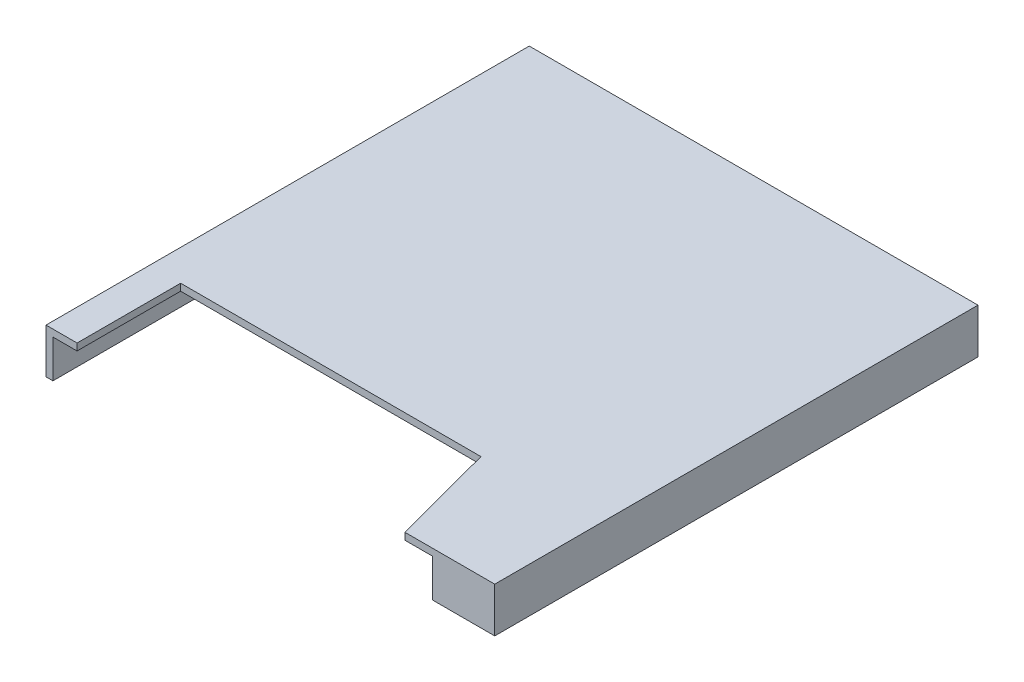
ISO-10303-21;
HEADER;
FILE_DESCRIPTION(('STEP AP214'),'2;1');
FILE_NAME('part.step','',(''),(''),'','','');
FILE_SCHEMA(('AUTOMOTIVE_DESIGN { 1 0 10303 214 1 1 1 1 }'));
ENDSEC;
DATA;
#1=APPLICATION_CONTEXT('core data for automotive mechanical design processes');
#2=APPLICATION_PROTOCOL_DEFINITION('international standard','automotive_design',2000,#1);
#3=PRODUCT_CONTEXT('',#1,'mechanical');
#4=PRODUCT('Part','Part','',(#3));
#5=PRODUCT_RELATED_PRODUCT_CATEGORY('part','',(#4));
#6=PRODUCT_DEFINITION_FORMATION('','',#4);
#7=PRODUCT_DEFINITION_CONTEXT('part definition',#1,'design');
#8=PRODUCT_DEFINITION('design','',#6,#7);
#9=PRODUCT_DEFINITION_SHAPE('','',#8);
#10=(LENGTH_UNIT() NAMED_UNIT(*) SI_UNIT(.MILLI.,.METRE.));
#11=(NAMED_UNIT(*) PLANE_ANGLE_UNIT() SI_UNIT($,.RADIAN.));
#12=(NAMED_UNIT(*) SI_UNIT($,.STERADIAN.) SOLID_ANGLE_UNIT());
#13=UNCERTAINTY_MEASURE_WITH_UNIT(LENGTH_MEASURE(1.E-05),#10,'distance_accuracy_value','');
#14=(GEOMETRIC_REPRESENTATION_CONTEXT(3) GLOBAL_UNCERTAINTY_ASSIGNED_CONTEXT((#13)) GLOBAL_UNIT_ASSIGNED_CONTEXT((#10,
#11,#12)) REPRESENTATION_CONTEXT('',''));
#15=CARTESIAN_POINT('',(0.,0.,0.));
#16=DIRECTION('',(0.,0.,1.));
#17=DIRECTION('',(1.,0.,0.));
#18=AXIS2_PLACEMENT_3D('',#15,#16,#17);
#19=CARTESIAN_POINT('',(6.5,0.,-6.8));
#20=DIRECTION('',(0.,0.,-1.));
#21=DIRECTION('',(-1.,0.,0.));
#22=AXIS2_PLACEMENT_3D('',#19,#20,#21);
#23=PLANE('',#22);
#24=DIRECTION('',(0.,1.,0.));
#25=VECTOR('',#24,1.);
#26=CARTESIAN_POINT('',(6.3,0.,-6.8));
#27=LINE('',#26,#25);
#28=CARTESIAN_POINT('',(6.3,0.,-6.8));
#29=VERTEX_POINT('',#28);
#30=CARTESIAN_POINT('',(6.3,1.1,-6.8));
#31=VERTEX_POINT('',#30);
#32=EDGE_CURVE('E20',#29,#31,#27,.T.);
#33=ORIENTED_EDGE('',*,*,#32,.T.);
#34=DIRECTION('',(1.,0.,0.));
#35=VECTOR('',#34,1.);
#36=CARTESIAN_POINT('',(0.,1.1,-6.8));
#37=LINE('',#36,#35);
#38=CARTESIAN_POINT('',(-6.3,1.1,-6.8));
#39=VERTEX_POINT('',#38);
#40=EDGE_CURVE('E122',#31,#39,#37,.F.);
#41=ORIENTED_EDGE('',*,*,#40,.T.);
#42=DIRECTION('',(0.,1.,0.));
#43=VECTOR('',#42,1.);
#44=CARTESIAN_POINT('',(-6.3,0.,-6.8));
#45=LINE('',#44,#43);
#46=CARTESIAN_POINT('',(-6.3,0.,-6.8));
#47=VERTEX_POINT('',#46);
#48=EDGE_CURVE('E131',#39,#47,#45,.F.);
#49=ORIENTED_EDGE('',*,*,#48,.T.);
#50=DIRECTION('',(1.,0.,0.));
#51=VECTOR('',#50,1.);
#52=CARTESIAN_POINT('',(0.,0.,-6.8));
#53=LINE('',#52,#51);
#54=EDGE_CURVE('E125',#47,#29,#53,.T.);
#55=ORIENTED_EDGE('',*,*,#54,.T.);
#56=EDGE_LOOP('',(#33,#41,#49,#55));
#57=FACE_BOUND('',#56,.T.);
#58=ADVANCED_FACE('F17',(#57),#23,.F.);
#59=CARTESIAN_POINT('',(6.3,0.,7.));
#60=DIRECTION('',(1.,0.,0.));
#61=DIRECTION('',(0.,0.,-1.));
#62=AXIS2_PLACEMENT_3D('',#59,#60,#61);
#63=PLANE('',#62);
#64=DIRECTION('',(0.,0.,1.));
#65=VECTOR('',#64,1.);
#66=CARTESIAN_POINT('',(6.3,1.1,0.));
#67=LINE('',#66,#65);
#68=CARTESIAN_POINT('',(6.3,1.1,6.8));
#69=VERTEX_POINT('',#68);
#70=EDGE_CURVE('E128',#69,#31,#67,.F.);
#71=ORIENTED_EDGE('',*,*,#70,.T.);
#72=ORIENTED_EDGE('',*,*,#32,.F.);
#73=DIRECTION('',(0.,0.,1.));
#74=VECTOR('',#73,1.);
#75=CARTESIAN_POINT('',(6.3,0.,0.));
#76=LINE('',#75,#74);
#77=CARTESIAN_POINT('',(6.3,0.,6.8));
#78=VERTEX_POINT('',#77);
#79=EDGE_CURVE('E156',#29,#78,#76,.T.);
#80=ORIENTED_EDGE('',*,*,#79,.T.);
#81=DIRECTION('',(0.,1.,0.));
#82=VECTOR('',#81,1.);
#83=CARTESIAN_POINT('',(6.3,1.1,6.8));
#84=LINE('',#83,#82);
#85=EDGE_CURVE('E116',#69,#78,#84,.F.);
#86=ORIENTED_EDGE('',*,*,#85,.F.);
#87=EDGE_LOOP('',(#71,#72,#80,#86));
#88=FACE_BOUND('',#87,.T.);
#89=ADVANCED_FACE('F129',(#88),#63,.F.);
#90=CARTESIAN_POINT('',(4.7,1.1,6.8));
#91=DIRECTION('',(0.,0.,-1.));
#92=DIRECTION('',(-1.,0.,0.));
#93=AXIS2_PLACEMENT_3D('',#90,#91,#92);
#94=PLANE('',#93);
#95=DIRECTION('',(1.,0.,0.));
#96=VECTOR('',#95,1.);
#97=CARTESIAN_POINT('',(0.,1.1,6.8));
#98=LINE('',#97,#96);
#99=CARTESIAN_POINT('',(4.7,1.1,6.8));
#100=VERTEX_POINT('',#99);
#101=EDGE_CURVE('E152',#100,#69,#98,.T.);
#102=ORIENTED_EDGE('',*,*,#101,.T.);
#103=ORIENTED_EDGE('',*,*,#85,.T.);
#104=DIRECTION('',(1.,0.,0.));
#105=VECTOR('',#104,1.);
#106=CARTESIAN_POINT('',(0.,0.,6.8));
#107=LINE('',#106,#105);
#108=CARTESIAN_POINT('',(4.7,0.,6.8));
#109=VERTEX_POINT('',#108);
#110=EDGE_CURVE('E150',#78,#109,#107,.F.);
#111=ORIENTED_EDGE('',*,*,#110,.T.);
#112=DIRECTION('',(0.,1.,0.));
#113=VECTOR('',#112,1.);
#114=CARTESIAN_POINT('',(4.7,1.1,6.8));
#115=LINE('',#114,#113);
#116=EDGE_CURVE('E166',#100,#109,#115,.F.);
#117=ORIENTED_EDGE('',*,*,#116,.F.);
#118=EDGE_LOOP('',(#102,#103,#111,#117));
#119=FACE_BOUND('',#118,.T.);
#120=ADVANCED_FACE('F148',(#119),#94,.T.);
#121=CARTESIAN_POINT('',(-6.3,0.,-7.));
#122=DIRECTION('',(-1.,0.,0.));
#123=DIRECTION('',(0.,0.,1.));
#124=AXIS2_PLACEMENT_3D('',#121,#122,#123);
#125=PLANE('',#124);
#126=ORIENTED_EDGE('',*,*,#48,.F.);
#127=DIRECTION('',(0.,0.,1.));
#128=VECTOR('',#127,1.);
#129=CARTESIAN_POINT('',(-6.3,1.1,0.));
#130=LINE('',#129,#128);
#131=CARTESIAN_POINT('',(-6.3,1.1,7.));
#132=VERTEX_POINT('',#131);
#133=EDGE_CURVE('E138',#39,#132,#130,.T.);
#134=ORIENTED_EDGE('',*,*,#133,.T.);
#135=DIRECTION('',(0.,1.,0.));
#136=VECTOR('',#135,1.);
#137=CARTESIAN_POINT('',(-6.3,0.,7.));
#138=LINE('',#137,#136);
#139=CARTESIAN_POINT('',(-6.3,0.,7.));
#140=VERTEX_POINT('',#139);
#141=EDGE_CURVE('E145',#140,#132,#138,.T.);
#142=ORIENTED_EDGE('',*,*,#141,.F.);
#143=DIRECTION('',(0.,0.,1.));
#144=VECTOR('',#143,1.);
#145=CARTESIAN_POINT('',(-6.3,0.,0.));
#146=LINE('',#145,#144);
#147=EDGE_CURVE('E187',#140,#47,#146,.F.);
#148=ORIENTED_EDGE('',*,*,#147,.T.);
#149=EDGE_LOOP('',(#126,#134,#142,#148));
#150=FACE_BOUND('',#149,.T.);
#151=ADVANCED_FACE('F231',(#150),#125,.F.);
#152=CARTESIAN_POINT('',(0.,1.1,0.));
#153=DIRECTION('',(0.,1.,0.));
#154=DIRECTION('',(0.,0.,1.));
#155=AXIS2_PLACEMENT_3D('',#152,#153,#154);
#156=PLANE('',#155);
#157=DIRECTION('',(0.,0.,1.));
#158=VECTOR('',#157,1.);
#159=CARTESIAN_POINT('',(4.7,1.1,7.));
#160=LINE('',#159,#158);
#161=CARTESIAN_POINT('',(4.7,1.1,7.));
#162=VERTEX_POINT('',#161);
#163=EDGE_CURVE('E168',#162,#100,#160,.F.);
#164=ORIENTED_EDGE('',*,*,#163,.F.);
#165=DIRECTION('',(1.,0.,0.));
#166=VECTOR('',#165,1.);
#167=CARTESIAN_POINT('',(0.,1.1,7.));
#168=LINE('',#167,#166);
#169=CARTESIAN_POINT('',(3.9,1.1,7.));
#170=VERTEX_POINT('',#169);
#171=EDGE_CURVE('E172',#170,#162,#168,.T.);
#172=ORIENTED_EDGE('',*,*,#171,.F.);
#173=DIRECTION('',(-0.257662650560333,0.,-0.966234939601246));
#174=VECTOR('',#173,1.);
#175=CARTESIAN_POINT('',(3.1,1.1,4.));
#176=LINE('',#175,#174);
#177=CARTESIAN_POINT('',(3.1,1.1,4.));
#178=VERTEX_POINT('',#177);
#179=EDGE_CURVE('E222',#170,#178,#176,.T.);
#180=ORIENTED_EDGE('',*,*,#179,.T.);
#181=DIRECTION('',(-1.,0.,0.));
#182=VECTOR('',#181,1.);
#183=CARTESIAN_POINT('',(-5.6,1.1,4.));
#184=LINE('',#183,#182);
#185=CARTESIAN_POINT('',(-5.6,1.1,4.));
#186=VERTEX_POINT('',#185);
#187=EDGE_CURVE('E183',#178,#186,#184,.T.);
#188=ORIENTED_EDGE('',*,*,#187,.T.);
#189=DIRECTION('',(0.,0.,1.));
#190=VECTOR('',#189,1.);
#191=CARTESIAN_POINT('',(-5.6,1.1,7.));
#192=LINE('',#191,#190);
#193=CARTESIAN_POINT('',(-5.6,1.1,7.));
#194=VERTEX_POINT('',#193);
#195=EDGE_CURVE('E181',#186,#194,#192,.T.);
#196=ORIENTED_EDGE('',*,*,#195,.T.);
#197=DIRECTION('',(1.,0.,0.));
#198=VECTOR('',#197,1.);
#199=CARTESIAN_POINT('',(0.,1.1,7.));
#200=LINE('',#199,#198);
#201=EDGE_CURVE('E140',#132,#194,#200,.T.);
#202=ORIENTED_EDGE('',*,*,#201,.F.);
#203=ORIENTED_EDGE('',*,*,#133,.F.);
#204=ORIENTED_EDGE('',*,*,#40,.F.);
#205=ORIENTED_EDGE('',*,*,#70,.F.);
#206=ORIENTED_EDGE('',*,*,#101,.F.);
#207=EDGE_LOOP('',(#164,#172,#180,#188,#196,#202,#203,#204,#205,#206));
#208=FACE_BOUND('',#207,.T.);
#209=ADVANCED_FACE('F135',(#208),#156,.F.);
#210=CARTESIAN_POINT('',(4.7,1.1,7.));
#211=DIRECTION('',(-1.,0.,0.));
#212=DIRECTION('',(0.,0.,1.));
#213=AXIS2_PLACEMENT_3D('',#210,#211,#212);
#214=PLANE('',#213);
#215=ORIENTED_EDGE('',*,*,#163,.T.);
#216=ORIENTED_EDGE('',*,*,#116,.T.);
#217=DIRECTION('',(0.,0.,1.));
#218=VECTOR('',#217,1.);
#219=CARTESIAN_POINT('',(4.7,0.,0.));
#220=LINE('',#219,#218);
#221=CARTESIAN_POINT('',(4.7,0.,7.));
#222=VERTEX_POINT('',#221);
#223=EDGE_CURVE('E158',#109,#222,#220,.T.);
#224=ORIENTED_EDGE('',*,*,#223,.T.);
#225=DIRECTION('',(0.,1.,0.));
#226=VECTOR('',#225,1.);
#227=CARTESIAN_POINT('',(4.7,0.,7.));
#228=LINE('',#227,#226);
#229=EDGE_CURVE('E216',#162,#222,#228,.F.);
#230=ORIENTED_EDGE('',*,*,#229,.F.);
#231=EDGE_LOOP('',(#215,#216,#224,#230));
#232=FACE_BOUND('',#231,.T.);
#233=ADVANCED_FACE('F239',(#232),#214,.T.);
#234=CARTESIAN_POINT('',(0.,0.,0.));
#235=DIRECTION('',(0.,1.,0.));
#236=DIRECTION('',(0.,0.,1.));
#237=AXIS2_PLACEMENT_3D('',#234,#235,#236);
#238=PLANE('',#237);
#239=DIRECTION('',(1.,0.,0.));
#240=VECTOR('',#239,1.);
#241=CARTESIAN_POINT('',(0.,0.,7.));
#242=LINE('',#241,#240);
#243=CARTESIAN_POINT('',(-6.5,0.,7.));
#244=VERTEX_POINT('',#243);
#245=EDGE_CURVE('E160',#244,#140,#242,.T.);
#246=ORIENTED_EDGE('',*,*,#245,.F.);
#247=DIRECTION('',(0.,0.,1.));
#248=VECTOR('',#247,1.);
#249=CARTESIAN_POINT('',(-6.5,0.,-7.));
#250=LINE('',#249,#248);
#251=CARTESIAN_POINT('',(-6.5,0.,-7.));
#252=VERTEX_POINT('',#251);
#253=EDGE_CURVE('E196',#252,#244,#250,.T.);
#254=ORIENTED_EDGE('',*,*,#253,.F.);
#255=DIRECTION('',(-1.,0.,0.));
#256=VECTOR('',#255,1.);
#257=CARTESIAN_POINT('',(6.5,0.,-7.));
#258=LINE('',#257,#256);
#259=CARTESIAN_POINT('',(6.5,0.,-7.));
#260=VERTEX_POINT('',#259);
#261=EDGE_CURVE('E204',#260,#252,#258,.T.);
#262=ORIENTED_EDGE('',*,*,#261,.F.);
#263=DIRECTION('',(0.,0.,-1.));
#264=VECTOR('',#263,1.);
#265=CARTESIAN_POINT('',(6.5,0.,7.));
#266=LINE('',#265,#264);
#267=CARTESIAN_POINT('',(6.5,0.,7.));
#268=VERTEX_POINT('',#267);
#269=EDGE_CURVE('E210',#268,#260,#266,.T.);
#270=ORIENTED_EDGE('',*,*,#269,.F.);
#271=DIRECTION('',(1.,0.,0.));
#272=VECTOR('',#271,1.);
#273=CARTESIAN_POINT('',(-6.5,0.,7.));
#274=LINE('',#273,#272);
#275=EDGE_CURVE('E213',#222,#268,#274,.T.);
#276=ORIENTED_EDGE('',*,*,#275,.F.);
#277=ORIENTED_EDGE('',*,*,#223,.F.);
#278=ORIENTED_EDGE('',*,*,#110,.F.);
#279=ORIENTED_EDGE('',*,*,#79,.F.);
#280=ORIENTED_EDGE('',*,*,#54,.F.);
#281=ORIENTED_EDGE('',*,*,#147,.F.);
#282=EDGE_LOOP('',(#246,#254,#262,#270,#276,#277,#278,#279,#280,#281));
#283=FACE_BOUND('',#282,.T.);
#284=ADVANCED_FACE('F155',(#283),#238,.F.);
#285=CARTESIAN_POINT('',(-5.6,1.3,7.));
#286=DIRECTION('',(-1.,0.,0.));
#287=DIRECTION('',(0.,0.,1.));
#288=AXIS2_PLACEMENT_3D('',#285,#286,#287);
#289=PLANE('',#288);
#290=DIRECTION('',(0.,1.,0.));
#291=VECTOR('',#290,1.);
#292=CARTESIAN_POINT('',(-5.6,1.3,4.));
#293=LINE('',#292,#291);
#294=CARTESIAN_POINT('',(-5.6,1.3,4.));
#295=VERTEX_POINT('',#294);
#296=EDGE_CURVE('E186',#186,#295,#293,.T.);
#297=ORIENTED_EDGE('',*,*,#296,.T.);
#298=DIRECTION('',(0.,0.,1.));
#299=VECTOR('',#298,1.);
#300=CARTESIAN_POINT('',(-5.6,1.3,0.));
#301=LINE('',#300,#299);
#302=CARTESIAN_POINT('',(-5.6,1.3,7.));
#303=VERTEX_POINT('',#302);
#304=EDGE_CURVE('E191',#303,#295,#301,.F.);
#305=ORIENTED_EDGE('',*,*,#304,.F.);
#306=DIRECTION('',(0.,1.,0.));
#307=VECTOR('',#306,1.);
#308=CARTESIAN_POINT('',(-5.6,0.,7.));
#309=LINE('',#308,#307);
#310=EDGE_CURVE('E178',#194,#303,#309,.T.);
#311=ORIENTED_EDGE('',*,*,#310,.F.);
#312=ORIENTED_EDGE('',*,*,#195,.F.);
#313=EDGE_LOOP('',(#297,#305,#311,#312));
#314=FACE_BOUND('',#313,.T.);
#315=ADVANCED_FACE('F189',(#314),#289,.F.);
#316=CARTESIAN_POINT('',(-5.6,1.3,4.));
#317=DIRECTION('',(0.,0.,-1.));
#318=DIRECTION('',(-1.,0.,0.));
#319=AXIS2_PLACEMENT_3D('',#316,#317,#318);
#320=PLANE('',#319);
#321=DIRECTION('',(0.,1.,0.));
#322=VECTOR('',#321,1.);
#323=CARTESIAN_POINT('',(3.1,1.3,4.));
#324=LINE('',#323,#322);
#325=CARTESIAN_POINT('',(3.1,1.3,4.));
#326=VERTEX_POINT('',#325);
#327=EDGE_CURVE('E224',#178,#326,#324,.T.);
#328=ORIENTED_EDGE('',*,*,#327,.T.);
#329=DIRECTION('',(1.,0.,0.));
#330=VECTOR('',#329,1.);
#331=CARTESIAN_POINT('',(0.,1.3,4.));
#332=LINE('',#331,#330);
#333=EDGE_CURVE('E298',#295,#326,#332,.T.);
#334=ORIENTED_EDGE('',*,*,#333,.F.);
#335=ORIENTED_EDGE('',*,*,#296,.F.);
#336=ORIENTED_EDGE('',*,*,#187,.F.);
#337=EDGE_LOOP('',(#328,#334,#335,#336));
#338=FACE_BOUND('',#337,.T.);
#339=ADVANCED_FACE('F270',(#338),#320,.F.);
#340=CARTESIAN_POINT('',(3.1,1.3,4.));
#341=DIRECTION('',(0.966234939601246,0.,-0.257662650560333));
#342=DIRECTION('',(-0.257662650560333,0.,-0.966234939601246));
#343=AXIS2_PLACEMENT_3D('',#340,#341,#342);
#344=PLANE('',#343);
#345=DIRECTION('',(0.,1.,0.));
#346=VECTOR('',#345,1.);
#347=CARTESIAN_POINT('',(3.9,0.,7.));
#348=LINE('',#347,#346);
#349=CARTESIAN_POINT('',(3.9,1.3,7.));
#350=VERTEX_POINT('',#349);
#351=EDGE_CURVE('E219',#350,#170,#348,.F.);
#352=ORIENTED_EDGE('',*,*,#351,.F.);
#353=DIRECTION('',(0.257662650560332,0.,0.966234939601246));
#354=VECTOR('',#353,1.);
#355=CARTESIAN_POINT('',(3.1,1.3,4.));
#356=LINE('',#355,#354);
#357=EDGE_CURVE('E294',#326,#350,#356,.T.);
#358=ORIENTED_EDGE('',*,*,#357,.F.);
#359=ORIENTED_EDGE('',*,*,#327,.F.);
#360=ORIENTED_EDGE('',*,*,#179,.F.);
#361=EDGE_LOOP('',(#352,#358,#359,#360));
#362=FACE_BOUND('',#361,.T.);
#363=ADVANCED_FACE('F266',(#362),#344,.F.);
#364=CARTESIAN_POINT('',(-6.5,0.,7.));
#365=DIRECTION('',(0.,0.,1.));
#366=DIRECTION('',(1.,0.,0.));
#367=AXIS2_PLACEMENT_3D('',#364,#365,#366);
#368=PLANE('',#367);
#369=DIRECTION('',(0.,1.,0.));
#370=VECTOR('',#369,1.);
#371=CARTESIAN_POINT('',(6.5,0.,7.));
#372=LINE('',#371,#370);
#373=CARTESIAN_POINT('',(6.5,1.3,7.));
#374=VERTEX_POINT('',#373);
#375=EDGE_CURVE('E207',#374,#268,#372,.F.);
#376=ORIENTED_EDGE('',*,*,#375,.F.);
#377=DIRECTION('',(1.,0.,0.));
#378=VECTOR('',#377,1.);
#379=CARTESIAN_POINT('',(0.,1.3,7.));
#380=LINE('',#379,#378);
#381=EDGE_CURVE('E289',#350,#374,#380,.T.);
#382=ORIENTED_EDGE('',*,*,#381,.F.);
#383=ORIENTED_EDGE('',*,*,#351,.T.);
#384=ORIENTED_EDGE('',*,*,#171,.T.);
#385=ORIENTED_EDGE('',*,*,#229,.T.);
#386=ORIENTED_EDGE('',*,*,#275,.T.);
#387=EDGE_LOOP('',(#376,#382,#383,#384,#385,#386));
#388=FACE_BOUND('',#387,.T.);
#389=ADVANCED_FACE('F262',(#388),#368,.T.);
#390=CARTESIAN_POINT('',(6.5,0.,7.));
#391=DIRECTION('',(1.,0.,0.));
#392=DIRECTION('',(0.,0.,-1.));
#393=AXIS2_PLACEMENT_3D('',#390,#391,#392);
#394=PLANE('',#393);
#395=DIRECTION('',(0.,0.,1.));
#396=VECTOR('',#395,1.);
#397=CARTESIAN_POINT('',(6.5,1.3,0.));
#398=LINE('',#397,#396);
#399=CARTESIAN_POINT('',(6.5,1.3,-7.));
#400=VERTEX_POINT('',#399);
#401=EDGE_CURVE('E293',#374,#400,#398,.F.);
#402=ORIENTED_EDGE('',*,*,#401,.F.);
#403=ORIENTED_EDGE('',*,*,#375,.T.);
#404=ORIENTED_EDGE('',*,*,#269,.T.);
#405=DIRECTION('',(0.,1.,0.));
#406=VECTOR('',#405,1.);
#407=CARTESIAN_POINT('',(6.5,0.,-7.));
#408=LINE('',#407,#406);
#409=EDGE_CURVE('E201',#400,#260,#408,.F.);
#410=ORIENTED_EDGE('',*,*,#409,.F.);
#411=EDGE_LOOP('',(#402,#403,#404,#410));
#412=FACE_BOUND('',#411,.T.);
#413=ADVANCED_FACE('F258',(#412),#394,.T.);
#414=CARTESIAN_POINT('',(6.5,0.,-7.));
#415=DIRECTION('',(0.,0.,-1.));
#416=DIRECTION('',(-1.,0.,0.));
#417=AXIS2_PLACEMENT_3D('',#414,#415,#416);
#418=PLANE('',#417);
#419=DIRECTION('',(1.,0.,0.));
#420=VECTOR('',#419,1.);
#421=CARTESIAN_POINT('',(0.,1.3,-7.));
#422=LINE('',#421,#420);
#423=CARTESIAN_POINT('',(-6.5,1.3,-7.));
#424=VERTEX_POINT('',#423);
#425=EDGE_CURVE('E304',#400,#424,#422,.F.);
#426=ORIENTED_EDGE('',*,*,#425,.F.);
#427=ORIENTED_EDGE('',*,*,#409,.T.);
#428=ORIENTED_EDGE('',*,*,#261,.T.);
#429=DIRECTION('',(0.,1.,0.));
#430=VECTOR('',#429,1.);
#431=CARTESIAN_POINT('',(-6.5,0.,-7.));
#432=LINE('',#431,#430);
#433=EDGE_CURVE('E192',#424,#252,#432,.F.);
#434=ORIENTED_EDGE('',*,*,#433,.F.);
#435=EDGE_LOOP('',(#426,#427,#428,#434));
#436=FACE_BOUND('',#435,.T.);
#437=ADVANCED_FACE('F255',(#436),#418,.T.);
#438=CARTESIAN_POINT('',(-6.5,0.,-7.));
#439=DIRECTION('',(-1.,0.,0.));
#440=DIRECTION('',(0.,0.,1.));
#441=AXIS2_PLACEMENT_3D('',#438,#439,#440);
#442=PLANE('',#441);
#443=DIRECTION('',(0.,0.,1.));
#444=VECTOR('',#443,1.);
#445=CARTESIAN_POINT('',(-6.5,1.3,0.));
#446=LINE('',#445,#444);
#447=CARTESIAN_POINT('',(-6.5,1.3,7.));
#448=VERTEX_POINT('',#447);
#449=EDGE_CURVE('E26',#424,#448,#446,.T.);
#450=ORIENTED_EDGE('',*,*,#449,.F.);
#451=ORIENTED_EDGE('',*,*,#433,.T.);
#452=ORIENTED_EDGE('',*,*,#253,.T.);
#453=DIRECTION('',(0.,1.,0.));
#454=VECTOR('',#453,1.);
#455=CARTESIAN_POINT('',(-6.5,0.,7.));
#456=LINE('',#455,#454);
#457=EDGE_CURVE('E35',#448,#244,#456,.F.);
#458=ORIENTED_EDGE('',*,*,#457,.F.);
#459=EDGE_LOOP('',(#450,#451,#452,#458));
#460=FACE_BOUND('',#459,.T.);
#461=ADVANCED_FACE('F249',(#460),#442,.T.);
#462=CARTESIAN_POINT('',(-6.5,0.,7.));
#463=DIRECTION('',(0.,0.,1.));
#464=DIRECTION('',(1.,0.,0.));
#465=AXIS2_PLACEMENT_3D('',#462,#463,#464);
#466=PLANE('',#465);
#467=ORIENTED_EDGE('',*,*,#141,.T.);
#468=ORIENTED_EDGE('',*,*,#201,.T.);
#469=ORIENTED_EDGE('',*,*,#310,.T.);
#470=DIRECTION('',(1.,0.,0.));
#471=VECTOR('',#470,1.);
#472=CARTESIAN_POINT('',(0.,1.3,7.));
#473=LINE('',#472,#471);
#474=EDGE_CURVE('E11',#448,#303,#473,.T.);
#475=ORIENTED_EDGE('',*,*,#474,.F.);
#476=ORIENTED_EDGE('',*,*,#457,.T.);
#477=ORIENTED_EDGE('',*,*,#245,.T.);
#478=EDGE_LOOP('',(#467,#468,#469,#475,#476,#477));
#479=FACE_BOUND('',#478,.T.);
#480=ADVANCED_FACE('F176',(#479),#466,.T.);
#481=CARTESIAN_POINT('',(0.,1.3,0.));
#482=DIRECTION('',(0.,1.,0.));
#483=DIRECTION('',(0.,0.,1.));
#484=AXIS2_PLACEMENT_3D('',#481,#482,#483);
#485=PLANE('',#484);
#486=ORIENTED_EDGE('',*,*,#449,.T.);
#487=ORIENTED_EDGE('',*,*,#474,.T.);
#488=ORIENTED_EDGE('',*,*,#304,.T.);
#489=ORIENTED_EDGE('',*,*,#333,.T.);
#490=ORIENTED_EDGE('',*,*,#357,.T.);
#491=ORIENTED_EDGE('',*,*,#381,.T.);
#492=ORIENTED_EDGE('',*,*,#401,.T.);
#493=ORIENTED_EDGE('',*,*,#425,.T.);
#494=EDGE_LOOP('',(#486,#487,#488,#489,#490,#491,#492,#493));
#495=FACE_BOUND('',#494,.T.);
#496=ADVANCED_FACE('F242',(#495),#485,.T.);
#497=CLOSED_SHELL('',(#58,#89,#120,#151,#209,#233,#284,#315,#339,#363,#389,#413,#437,#461,#480,#496));
#498=MANIFOLD_SOLID_BREP('B1',#497);
#499=ADVANCED_BREP_SHAPE_REPRESENTATION('',(#18,#498),#14);
#500=SHAPE_DEFINITION_REPRESENTATION(#9,#499);
ENDSEC;
END-ISO-10303-21;
